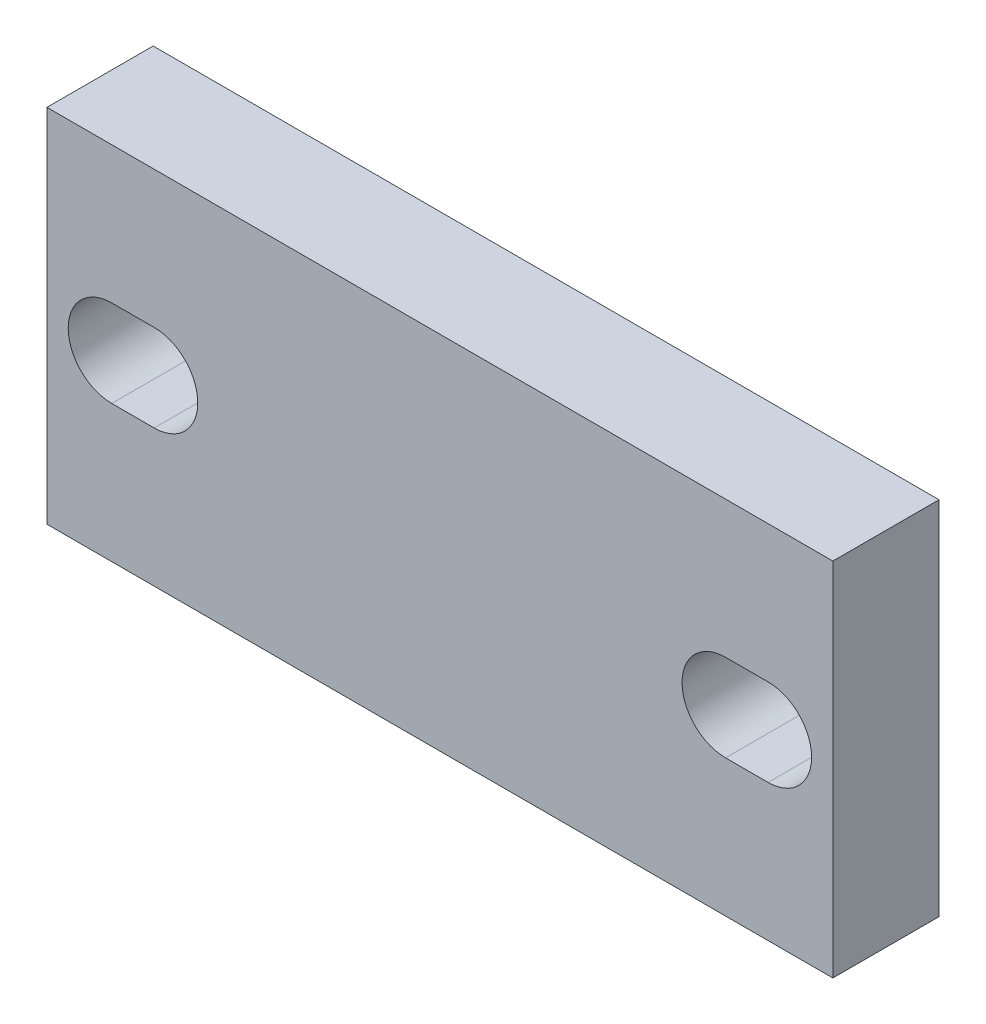
ISO-10303-21;
HEADER;
FILE_DESCRIPTION(('STEP AP214'),'2;1');
FILE_NAME('part.step','',(''),(''),'','','');
FILE_SCHEMA(('AUTOMOTIVE_DESIGN { 1 0 10303 214 1 1 1 1 }'));
ENDSEC;
DATA;
#1=APPLICATION_CONTEXT('core data for automotive mechanical design processes');
#2=APPLICATION_PROTOCOL_DEFINITION('international standard','automotive_design',2000,#1);
#3=PRODUCT_CONTEXT('',#1,'mechanical');
#4=PRODUCT('Part','Part','',(#3));
#5=PRODUCT_RELATED_PRODUCT_CATEGORY('part','',(#4));
#6=PRODUCT_DEFINITION_FORMATION('','',#4);
#7=PRODUCT_DEFINITION_CONTEXT('part definition',#1,'design');
#8=PRODUCT_DEFINITION('design','',#6,#7);
#9=PRODUCT_DEFINITION_SHAPE('','',#8);
#10=(LENGTH_UNIT() NAMED_UNIT(*) SI_UNIT(.MILLI.,.METRE.));
#11=(NAMED_UNIT(*) PLANE_ANGLE_UNIT() SI_UNIT($,.RADIAN.));
#12=(NAMED_UNIT(*) SI_UNIT($,.STERADIAN.) SOLID_ANGLE_UNIT());
#13=UNCERTAINTY_MEASURE_WITH_UNIT(LENGTH_MEASURE(1.E-05),#10,'distance_accuracy_value','');
#14=(GEOMETRIC_REPRESENTATION_CONTEXT(3) GLOBAL_UNCERTAINTY_ASSIGNED_CONTEXT((#13)) GLOBAL_UNIT_ASSIGNED_CONTEXT((#10,
#11,#12)) REPRESENTATION_CONTEXT('',''));
#15=CARTESIAN_POINT('',(0.,0.,0.));
#16=DIRECTION('',(0.,0.,1.));
#17=DIRECTION('',(1.,0.,0.));
#18=AXIS2_PLACEMENT_3D('',#15,#16,#17);
#19=CARTESIAN_POINT('',(0.,0.,5.));
#20=DIRECTION('',(0.,0.,-1.));
#21=DIRECTION('',(-1.,0.,0.));
#22=AXIS2_PLACEMENT_3D('',#19,#20,#21);
#23=PLANE('',#22);
#24=CARTESIAN_POINT('',(-15.45,0.,5.));
#25=DIRECTION('',(0.,0.,1.));
#26=DIRECTION('',(1.,0.,0.));
#27=AXIS2_PLACEMENT_3D('',#24,#25,#26);
#28=CIRCLE('',#27,2.05);
#29=CARTESIAN_POINT('',(-15.45,2.05,5.));
#30=VERTEX_POINT('',#29);
#31=CARTESIAN_POINT('',(-15.45,-2.05,5.));
#32=VERTEX_POINT('',#31);
#33=EDGE_CURVE('E161',#30,#32,#28,.T.);
#34=ORIENTED_EDGE('',*,*,#33,.F.);
#35=DIRECTION('',(-1.,0.,0.));
#36=VECTOR('',#35,1.);
#37=CARTESIAN_POINT('',(-15.45,2.05,5.));
#38=LINE('',#37,#36);
#39=CARTESIAN_POINT('',(-13.45,2.05,5.));
#40=VERTEX_POINT('',#39);
#41=EDGE_CURVE('E169',#40,#30,#38,.T.);
#42=ORIENTED_EDGE('',*,*,#41,.F.);
#43=CARTESIAN_POINT('',(-13.45,0.,5.));
#44=DIRECTION('',(0.,0.,1.));
#45=DIRECTION('',(1.,0.,0.));
#46=AXIS2_PLACEMENT_3D('',#43,#44,#45);
#47=CIRCLE('',#46,2.05);
#48=CARTESIAN_POINT('',(-13.45,-2.05,5.));
#49=VERTEX_POINT('',#48);
#50=EDGE_CURVE('E166',#49,#40,#47,.T.);
#51=ORIENTED_EDGE('',*,*,#50,.F.);
#52=DIRECTION('',(1.,0.,0.));
#53=VECTOR('',#52,1.);
#54=CARTESIAN_POINT('',(-15.45,-2.05,5.));
#55=LINE('',#54,#53);
#56=EDGE_CURVE('E163',#32,#49,#55,.T.);
#57=ORIENTED_EDGE('',*,*,#56,.F.);
#58=EDGE_LOOP('',(#34,#42,#51,#57));
#59=FACE_BOUND('',#58,.T.);
#60=DIRECTION('',(0.,1.,0.));
#61=VECTOR('',#60,1.);
#62=CARTESIAN_POINT('',(18.5,-8.5,5.));
#63=LINE('',#62,#61);
#64=CARTESIAN_POINT('',(18.5,-8.5,5.));
#65=VERTEX_POINT('',#64);
#66=CARTESIAN_POINT('',(18.5,8.5,5.));
#67=VERTEX_POINT('',#66);
#68=EDGE_CURVE('E192',#65,#67,#63,.T.);
#69=ORIENTED_EDGE('',*,*,#68,.T.);
#70=DIRECTION('',(-1.,0.,0.));
#71=VECTOR('',#70,1.);
#72=CARTESIAN_POINT('',(-18.5,8.5,5.));
#73=LINE('',#72,#71);
#74=CARTESIAN_POINT('',(-18.5,8.5,5.));
#75=VERTEX_POINT('',#74);
#76=EDGE_CURVE('E195',#67,#75,#73,.T.);
#77=ORIENTED_EDGE('',*,*,#76,.T.);
#78=DIRECTION('',(0.,-1.,0.));
#79=VECTOR('',#78,1.);
#80=CARTESIAN_POINT('',(-18.5,-8.5,5.));
#81=LINE('',#80,#79);
#82=CARTESIAN_POINT('',(-18.5,-8.5,5.));
#83=VERTEX_POINT('',#82);
#84=EDGE_CURVE('E198',#75,#83,#81,.T.);
#85=ORIENTED_EDGE('',*,*,#84,.T.);
#86=DIRECTION('',(1.,0.,0.));
#87=VECTOR('',#86,1.);
#88=CARTESIAN_POINT('',(-18.5,-8.5,5.));
#89=LINE('',#88,#87);
#90=EDGE_CURVE('E200',#83,#65,#89,.T.);
#91=ORIENTED_EDGE('',*,*,#90,.T.);
#92=EDGE_LOOP('',(#69,#77,#85,#91));
#93=FACE_BOUND('',#92,.T.);
#94=CARTESIAN_POINT('',(15.45,0.,5.));
#95=DIRECTION('',(0.,0.,1.));
#96=DIRECTION('',(-1.,0.,0.));
#97=AXIS2_PLACEMENT_3D('',#94,#95,#96);
#98=CIRCLE('',#97,2.05);
#99=CARTESIAN_POINT('',(15.45,-2.05,5.));
#100=VERTEX_POINT('',#99);
#101=CARTESIAN_POINT('',(15.45,2.05,5.));
#102=VERTEX_POINT('',#101);
#103=EDGE_CURVE('E125',#100,#102,#98,.T.);
#104=ORIENTED_EDGE('',*,*,#103,.F.);
#105=DIRECTION('',(1.,0.,0.));
#106=VECTOR('',#105,1.);
#107=CARTESIAN_POINT('',(15.45,-2.05,5.));
#108=LINE('',#107,#106);
#109=CARTESIAN_POINT('',(13.45,-2.05,5.));
#110=VERTEX_POINT('',#109);
#111=EDGE_CURVE('E147',#110,#100,#108,.T.);
#112=ORIENTED_EDGE('',*,*,#111,.F.);
#113=CARTESIAN_POINT('',(13.45,0.,5.));
#114=DIRECTION('',(0.,0.,1.));
#115=DIRECTION('',(-1.,0.,0.));
#116=AXIS2_PLACEMENT_3D('',#113,#114,#115);
#117=CIRCLE('',#116,2.05);
#118=CARTESIAN_POINT('',(13.45,2.05,5.));
#119=VERTEX_POINT('',#118);
#120=EDGE_CURVE('E145',#119,#110,#117,.T.);
#121=ORIENTED_EDGE('',*,*,#120,.F.);
#122=DIRECTION('',(-1.,0.,0.));
#123=VECTOR('',#122,1.);
#124=CARTESIAN_POINT('',(15.45,2.05,5.));
#125=LINE('',#124,#123);
#126=EDGE_CURVE('E133',#102,#119,#125,.T.);
#127=ORIENTED_EDGE('',*,*,#126,.F.);
#128=EDGE_LOOP('',(#104,#112,#121,#127));
#129=FACE_BOUND('',#128,.T.);
#130=ADVANCED_FACE('F36',(#59,#93,#129),#23,.F.);
#131=CARTESIAN_POINT('',(0.,0.,0.));
#132=DIRECTION('',(0.,0.,-1.));
#133=DIRECTION('',(-1.,0.,0.));
#134=AXIS2_PLACEMENT_3D('',#131,#132,#133);
#135=PLANE('',#134);
#136=DIRECTION('',(0.,1.,0.));
#137=VECTOR('',#136,1.);
#138=CARTESIAN_POINT('',(18.5,-8.5,0.));
#139=LINE('',#138,#137);
#140=CARTESIAN_POINT('',(18.5,-8.5,0.));
#141=VERTEX_POINT('',#140);
#142=CARTESIAN_POINT('',(18.5,8.5,0.));
#143=VERTEX_POINT('',#142);
#144=EDGE_CURVE('E191',#141,#143,#139,.T.);
#145=ORIENTED_EDGE('',*,*,#144,.F.);
#146=DIRECTION('',(1.,0.,0.));
#147=VECTOR('',#146,1.);
#148=CARTESIAN_POINT('',(-18.5,-8.5,0.));
#149=LINE('',#148,#147);
#150=CARTESIAN_POINT('',(-18.5,-8.5,0.));
#151=VERTEX_POINT('',#150);
#152=EDGE_CURVE('E196',#151,#141,#149,.T.);
#153=ORIENTED_EDGE('',*,*,#152,.F.);
#154=DIRECTION('',(0.,-1.,0.));
#155=VECTOR('',#154,1.);
#156=CARTESIAN_POINT('',(-18.5,-8.5,0.));
#157=LINE('',#156,#155);
#158=CARTESIAN_POINT('',(-18.5,8.5,0.));
#159=VERTEX_POINT('',#158);
#160=EDGE_CURVE('E207',#159,#151,#157,.T.);
#161=ORIENTED_EDGE('',*,*,#160,.F.);
#162=DIRECTION('',(-1.,0.,0.));
#163=VECTOR('',#162,1.);
#164=CARTESIAN_POINT('',(-18.5,8.5,0.));
#165=LINE('',#164,#163);
#166=EDGE_CURVE('E205',#143,#159,#165,.T.);
#167=ORIENTED_EDGE('',*,*,#166,.F.);
#168=EDGE_LOOP('',(#145,#153,#161,#167));
#169=FACE_BOUND('',#168,.T.);
#170=DIRECTION('',(-1.,0.,0.));
#171=VECTOR('',#170,1.);
#172=CARTESIAN_POINT('',(-15.45,2.05,0.));
#173=LINE('',#172,#171);
#174=CARTESIAN_POINT('',(-13.45,2.05,0.));
#175=VERTEX_POINT('',#174);
#176=CARTESIAN_POINT('',(-15.45,2.05,0.));
#177=VERTEX_POINT('',#176);
#178=EDGE_CURVE('E164',#175,#177,#173,.T.);
#179=ORIENTED_EDGE('',*,*,#178,.T.);
#180=CARTESIAN_POINT('',(-15.45,0.,0.));
#181=DIRECTION('',(0.,0.,1.));
#182=DIRECTION('',(1.,0.,0.));
#183=AXIS2_PLACEMENT_3D('',#180,#181,#182);
#184=CIRCLE('',#183,2.05);
#185=CARTESIAN_POINT('',(-15.45,-2.05,0.));
#186=VERTEX_POINT('',#185);
#187=EDGE_CURVE('E141',#177,#186,#184,.T.);
#188=ORIENTED_EDGE('',*,*,#187,.T.);
#189=DIRECTION('',(1.,0.,0.));
#190=VECTOR('',#189,1.);
#191=CARTESIAN_POINT('',(-15.45,-2.05,0.));
#192=LINE('',#191,#190);
#193=CARTESIAN_POINT('',(-13.45,-2.05,0.));
#194=VERTEX_POINT('',#193);
#195=EDGE_CURVE('E174',#186,#194,#192,.T.);
#196=ORIENTED_EDGE('',*,*,#195,.T.);
#197=CARTESIAN_POINT('',(-13.45,0.,0.));
#198=DIRECTION('',(0.,0.,1.));
#199=DIRECTION('',(1.,0.,0.));
#200=AXIS2_PLACEMENT_3D('',#197,#198,#199);
#201=CIRCLE('',#200,2.05);
#202=EDGE_CURVE('E177',#194,#175,#201,.T.);
#203=ORIENTED_EDGE('',*,*,#202,.T.);
#204=EDGE_LOOP('',(#179,#188,#196,#203));
#205=FACE_BOUND('',#204,.T.);
#206=DIRECTION('',(1.,0.,0.));
#207=VECTOR('',#206,1.);
#208=CARTESIAN_POINT('',(15.45,-2.05,0.));
#209=LINE('',#208,#207);
#210=CARTESIAN_POINT('',(13.45,-2.05,0.));
#211=VERTEX_POINT('',#210);
#212=CARTESIAN_POINT('',(15.45,-2.05,0.));
#213=VERTEX_POINT('',#212);
#214=EDGE_CURVE('E134',#211,#213,#209,.T.);
#215=ORIENTED_EDGE('',*,*,#214,.T.);
#216=CARTESIAN_POINT('',(15.45,0.,0.));
#217=DIRECTION('',(0.,0.,1.));
#218=DIRECTION('',(-1.,0.,0.));
#219=AXIS2_PLACEMENT_3D('',#216,#217,#218);
#220=CIRCLE('',#219,2.05);
#221=CARTESIAN_POINT('',(15.45,2.05,0.));
#222=VERTEX_POINT('',#221);
#223=EDGE_CURVE('E59',#213,#222,#220,.T.);
#224=ORIENTED_EDGE('',*,*,#223,.T.);
#225=DIRECTION('',(-1.,0.,0.));
#226=VECTOR('',#225,1.);
#227=CARTESIAN_POINT('',(15.45,2.05,0.));
#228=LINE('',#227,#226);
#229=CARTESIAN_POINT('',(13.45,2.05,0.));
#230=VERTEX_POINT('',#229);
#231=EDGE_CURVE('E140',#222,#230,#228,.T.);
#232=ORIENTED_EDGE('',*,*,#231,.T.);
#233=CARTESIAN_POINT('',(13.45,0.,0.));
#234=DIRECTION('',(0.,0.,1.));
#235=DIRECTION('',(-1.,0.,0.));
#236=AXIS2_PLACEMENT_3D('',#233,#234,#235);
#237=CIRCLE('',#236,2.05);
#238=EDGE_CURVE('E153',#230,#211,#237,.T.);
#239=ORIENTED_EDGE('',*,*,#238,.T.);
#240=EDGE_LOOP('',(#215,#224,#232,#239));
#241=FACE_BOUND('',#240,.T.);
#242=ADVANCED_FACE('F225',(#169,#205,#241),#135,.T.);
#243=CARTESIAN_POINT('',(18.5,-8.5,5.));
#244=DIRECTION('',(-1.,0.,0.));
#245=DIRECTION('',(0.,0.,1.));
#246=AXIS2_PLACEMENT_3D('',#243,#244,#245);
#247=PLANE('',#246);
#248=ORIENTED_EDGE('',*,*,#144,.T.);
#249=DIRECTION('',(0.,0.,-1.));
#250=VECTOR('',#249,1.);
#251=CARTESIAN_POINT('',(18.5,8.5,5.));
#252=LINE('',#251,#250);
#253=EDGE_CURVE('E11',#67,#143,#252,.T.);
#254=ORIENTED_EDGE('',*,*,#253,.F.);
#255=ORIENTED_EDGE('',*,*,#68,.F.);
#256=DIRECTION('',(0.,0.,-1.));
#257=VECTOR('',#256,1.);
#258=CARTESIAN_POINT('',(18.5,-8.5,5.));
#259=LINE('',#258,#257);
#260=EDGE_CURVE('E202',#65,#141,#259,.T.);
#261=ORIENTED_EDGE('',*,*,#260,.T.);
#262=EDGE_LOOP('',(#248,#254,#255,#261));
#263=FACE_BOUND('',#262,.T.);
#264=ADVANCED_FACE('F38',(#263),#247,.F.);
#265=CARTESIAN_POINT('',(-18.5,8.5,5.));
#266=DIRECTION('',(0.,-1.,0.));
#267=DIRECTION('',(0.,0.,-1.));
#268=AXIS2_PLACEMENT_3D('',#265,#266,#267);
#269=PLANE('',#268);
#270=ORIENTED_EDGE('',*,*,#166,.T.);
#271=DIRECTION('',(0.,0.,-1.));
#272=VECTOR('',#271,1.);
#273=CARTESIAN_POINT('',(-18.5,8.5,5.));
#274=LINE('',#273,#272);
#275=EDGE_CURVE('E44',#75,#159,#274,.T.);
#276=ORIENTED_EDGE('',*,*,#275,.F.);
#277=ORIENTED_EDGE('',*,*,#76,.F.);
#278=ORIENTED_EDGE('',*,*,#253,.T.);
#279=EDGE_LOOP('',(#270,#276,#277,#278));
#280=FACE_BOUND('',#279,.T.);
#281=ADVANCED_FACE('F235',(#280),#269,.F.);
#282=CARTESIAN_POINT('',(-18.5,-8.5,5.));
#283=DIRECTION('',(1.,0.,0.));
#284=DIRECTION('',(0.,0.,-1.));
#285=AXIS2_PLACEMENT_3D('',#282,#283,#284);
#286=PLANE('',#285);
#287=ORIENTED_EDGE('',*,*,#160,.T.);
#288=DIRECTION('',(0.,0.,-1.));
#289=VECTOR('',#288,1.);
#290=CARTESIAN_POINT('',(-18.5,-8.5,5.));
#291=LINE('',#290,#289);
#292=EDGE_CURVE('E212',#83,#151,#291,.T.);
#293=ORIENTED_EDGE('',*,*,#292,.F.);
#294=ORIENTED_EDGE('',*,*,#84,.F.);
#295=ORIENTED_EDGE('',*,*,#275,.T.);
#296=EDGE_LOOP('',(#287,#293,#294,#295));
#297=FACE_BOUND('',#296,.T.);
#298=ADVANCED_FACE('F219',(#297),#286,.F.);
#299=CARTESIAN_POINT('',(-18.5,-8.5,5.));
#300=DIRECTION('',(0.,1.,0.));
#301=DIRECTION('',(-1.,0.,0.));
#302=AXIS2_PLACEMENT_3D('',#299,#300,#301);
#303=PLANE('',#302);
#304=ORIENTED_EDGE('',*,*,#152,.T.);
#305=ORIENTED_EDGE('',*,*,#260,.F.);
#306=ORIENTED_EDGE('',*,*,#90,.F.);
#307=ORIENTED_EDGE('',*,*,#292,.T.);
#308=EDGE_LOOP('',(#304,#305,#306,#307));
#309=FACE_BOUND('',#308,.T.);
#310=ADVANCED_FACE('F229',(#309),#303,.F.);
#311=CARTESIAN_POINT('',(-15.45,0.,5.));
#312=DIRECTION('',(0.,0.,-1.));
#313=DIRECTION('',(-1.,0.,0.));
#314=AXIS2_PLACEMENT_3D('',#311,#312,#313);
#315=CYLINDRICAL_SURFACE('',#314,2.05);
#316=ORIENTED_EDGE('',*,*,#187,.F.);
#317=DIRECTION('',(0.,0.,-1.));
#318=VECTOR('',#317,1.);
#319=CARTESIAN_POINT('',(-15.45,2.05,5.));
#320=LINE('',#319,#318);
#321=EDGE_CURVE('E171',#30,#177,#320,.T.);
#322=ORIENTED_EDGE('',*,*,#321,.F.);
#323=ORIENTED_EDGE('',*,*,#33,.T.);
#324=DIRECTION('',(0.,0.,-1.));
#325=VECTOR('',#324,1.);
#326=CARTESIAN_POINT('',(-15.45,-2.05,5.));
#327=LINE('',#326,#325);
#328=EDGE_CURVE('E188',#32,#186,#327,.T.);
#329=ORIENTED_EDGE('',*,*,#328,.T.);
#330=EDGE_LOOP('',(#316,#322,#323,#329));
#331=FACE_BOUND('',#330,.T.);
#332=ADVANCED_FACE('F251',(#331),#315,.F.);
#333=CARTESIAN_POINT('',(-15.45,-2.05,5.));
#334=DIRECTION('',(0.,1.,0.));
#335=DIRECTION('',(0.,0.,1.));
#336=AXIS2_PLACEMENT_3D('',#333,#334,#335);
#337=PLANE('',#336);
#338=ORIENTED_EDGE('',*,*,#195,.F.);
#339=ORIENTED_EDGE('',*,*,#328,.F.);
#340=ORIENTED_EDGE('',*,*,#56,.T.);
#341=DIRECTION('',(0.,0.,-1.));
#342=VECTOR('',#341,1.);
#343=CARTESIAN_POINT('',(-13.45,-2.05,5.));
#344=LINE('',#343,#342);
#345=EDGE_CURVE('E186',#49,#194,#344,.T.);
#346=ORIENTED_EDGE('',*,*,#345,.T.);
#347=EDGE_LOOP('',(#338,#339,#340,#346));
#348=FACE_BOUND('',#347,.T.);
#349=ADVANCED_FACE('F258',(#348),#337,.T.);
#350=CARTESIAN_POINT('',(-13.45,0.,5.));
#351=DIRECTION('',(0.,0.,-1.));
#352=DIRECTION('',(-1.,0.,0.));
#353=AXIS2_PLACEMENT_3D('',#350,#351,#352);
#354=CYLINDRICAL_SURFACE('',#353,2.05);
#355=ORIENTED_EDGE('',*,*,#202,.F.);
#356=ORIENTED_EDGE('',*,*,#345,.F.);
#357=ORIENTED_EDGE('',*,*,#50,.T.);
#358=DIRECTION('',(0.,0.,-1.));
#359=VECTOR('',#358,1.);
#360=CARTESIAN_POINT('',(-13.45,2.05,5.));
#361=LINE('',#360,#359);
#362=EDGE_CURVE('E184',#40,#175,#361,.T.);
#363=ORIENTED_EDGE('',*,*,#362,.T.);
#364=EDGE_LOOP('',(#355,#356,#357,#363));
#365=FACE_BOUND('',#364,.T.);
#366=ADVANCED_FACE('F263',(#365),#354,.F.);
#367=CARTESIAN_POINT('',(-15.45,2.05,5.));
#368=DIRECTION('',(0.,-1.,0.));
#369=DIRECTION('',(0.,0.,-1.));
#370=AXIS2_PLACEMENT_3D('',#367,#368,#369);
#371=PLANE('',#370);
#372=ORIENTED_EDGE('',*,*,#178,.F.);
#373=ORIENTED_EDGE('',*,*,#362,.F.);
#374=ORIENTED_EDGE('',*,*,#41,.T.);
#375=ORIENTED_EDGE('',*,*,#321,.T.);
#376=EDGE_LOOP('',(#372,#373,#374,#375));
#377=FACE_BOUND('',#376,.T.);
#378=ADVANCED_FACE('F269',(#377),#371,.T.);
#379=CARTESIAN_POINT('',(15.45,0.,5.));
#380=DIRECTION('',(0.,0.,-1.));
#381=DIRECTION('',(-1.,0.,0.));
#382=AXIS2_PLACEMENT_3D('',#379,#380,#381);
#383=CYLINDRICAL_SURFACE('',#382,2.05);
#384=ORIENTED_EDGE('',*,*,#223,.F.);
#385=DIRECTION('',(0.,0.,-1.));
#386=VECTOR('',#385,1.);
#387=CARTESIAN_POINT('',(15.45,-2.05,5.));
#388=LINE('',#387,#386);
#389=EDGE_CURVE('E129',#100,#213,#388,.T.);
#390=ORIENTED_EDGE('',*,*,#389,.F.);
#391=ORIENTED_EDGE('',*,*,#103,.T.);
#392=DIRECTION('',(0.,0.,-1.));
#393=VECTOR('',#392,1.);
#394=CARTESIAN_POINT('',(15.45,2.05,5.));
#395=LINE('',#394,#393);
#396=EDGE_CURVE('E128',#102,#222,#395,.T.);
#397=ORIENTED_EDGE('',*,*,#396,.T.);
#398=EDGE_LOOP('',(#384,#390,#391,#397));
#399=FACE_BOUND('',#398,.T.);
#400=ADVANCED_FACE('F127',(#399),#383,.F.);
#401=CARTESIAN_POINT('',(15.45,2.05,5.));
#402=DIRECTION('',(0.,-1.,0.));
#403=DIRECTION('',(0.,0.,-1.));
#404=AXIS2_PLACEMENT_3D('',#401,#402,#403);
#405=PLANE('',#404);
#406=ORIENTED_EDGE('',*,*,#231,.F.);
#407=ORIENTED_EDGE('',*,*,#396,.F.);
#408=ORIENTED_EDGE('',*,*,#126,.T.);
#409=DIRECTION('',(0.,0.,-1.));
#410=VECTOR('',#409,1.);
#411=CARTESIAN_POINT('',(13.45,2.05,5.));
#412=LINE('',#411,#410);
#413=EDGE_CURVE('E142',#119,#230,#412,.T.);
#414=ORIENTED_EDGE('',*,*,#413,.T.);
#415=EDGE_LOOP('',(#406,#407,#408,#414));
#416=FACE_BOUND('',#415,.T.);
#417=ADVANCED_FACE('F137',(#416),#405,.T.);
#418=CARTESIAN_POINT('',(13.45,0.,5.));
#419=DIRECTION('',(0.,0.,-1.));
#420=DIRECTION('',(-1.,0.,0.));
#421=AXIS2_PLACEMENT_3D('',#418,#419,#420);
#422=CYLINDRICAL_SURFACE('',#421,2.05);
#423=ORIENTED_EDGE('',*,*,#238,.F.);
#424=ORIENTED_EDGE('',*,*,#413,.F.);
#425=ORIENTED_EDGE('',*,*,#120,.T.);
#426=DIRECTION('',(0.,0.,-1.));
#427=VECTOR('',#426,1.);
#428=CARTESIAN_POINT('',(13.45,-2.05,5.));
#429=LINE('',#428,#427);
#430=EDGE_CURVE('E51',#110,#211,#429,.T.);
#431=ORIENTED_EDGE('',*,*,#430,.T.);
#432=EDGE_LOOP('',(#423,#424,#425,#431));
#433=FACE_BOUND('',#432,.T.);
#434=ADVANCED_FACE('F288',(#433),#422,.F.);
#435=CARTESIAN_POINT('',(15.45,-2.05,5.));
#436=DIRECTION('',(0.,1.,0.));
#437=DIRECTION('',(0.,0.,1.));
#438=AXIS2_PLACEMENT_3D('',#435,#436,#437);
#439=PLANE('',#438);
#440=ORIENTED_EDGE('',*,*,#214,.F.);
#441=ORIENTED_EDGE('',*,*,#430,.F.);
#442=ORIENTED_EDGE('',*,*,#111,.T.);
#443=ORIENTED_EDGE('',*,*,#389,.T.);
#444=EDGE_LOOP('',(#440,#441,#442,#443));
#445=FACE_BOUND('',#444,.T.);
#446=ADVANCED_FACE('F291',(#445),#439,.T.);
#447=CLOSED_SHELL('',(#130,#242,#264,#281,#298,#310,#332,#349,#366,#378,#400,#417,#434,#446));
#448=MANIFOLD_SOLID_BREP('B2',#447);
#449=ADVANCED_BREP_SHAPE_REPRESENTATION('',(#18,#448),#14);
#450=SHAPE_DEFINITION_REPRESENTATION(#9,#449);
ENDSEC;
END-ISO-10303-21;
